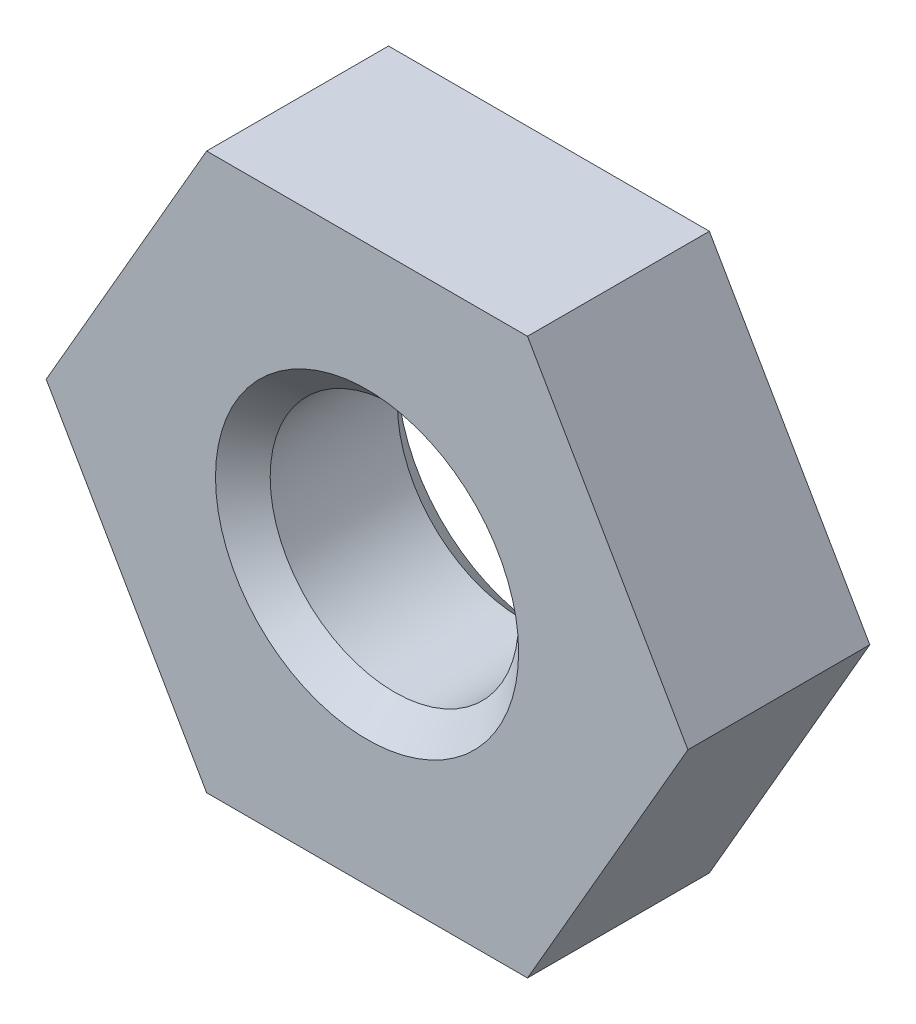
ISO-10303-21;
HEADER;
FILE_DESCRIPTION(('STEP AP214'),'2;1');
FILE_NAME('part.step','',(''),(''),'','','');
FILE_SCHEMA(('AUTOMOTIVE_DESIGN { 1 0 10303 214 1 1 1 1 }'));
ENDSEC;
DATA;
#1=APPLICATION_CONTEXT('core data for automotive mechanical design processes');
#2=APPLICATION_PROTOCOL_DEFINITION('international standard','automotive_design',2000,#1);
#3=PRODUCT_CONTEXT('',#1,'mechanical');
#4=PRODUCT('Part','Part','',(#3));
#5=PRODUCT_RELATED_PRODUCT_CATEGORY('part','',(#4));
#6=PRODUCT_DEFINITION_FORMATION('','',#4);
#7=PRODUCT_DEFINITION_CONTEXT('part definition',#1,'design');
#8=PRODUCT_DEFINITION('design','',#6,#7);
#9=PRODUCT_DEFINITION_SHAPE('','',#8);
#10=(LENGTH_UNIT() NAMED_UNIT(*) SI_UNIT(.MILLI.,.METRE.));
#11=(NAMED_UNIT(*) PLANE_ANGLE_UNIT() SI_UNIT($,.RADIAN.));
#12=(NAMED_UNIT(*) SI_UNIT($,.STERADIAN.) SOLID_ANGLE_UNIT());
#13=UNCERTAINTY_MEASURE_WITH_UNIT(LENGTH_MEASURE(1.E-05),#10,'distance_accuracy_value','');
#14=(GEOMETRIC_REPRESENTATION_CONTEXT(3) GLOBAL_UNCERTAINTY_ASSIGNED_CONTEXT((#13)) GLOBAL_UNIT_ASSIGNED_CONTEXT((#10,
#11,#12)) REPRESENTATION_CONTEXT('',''));
#15=CARTESIAN_POINT('',(0.,0.,0.));
#16=DIRECTION('',(0.,0.,1.));
#17=DIRECTION('',(1.,0.,0.));
#18=AXIS2_PLACEMENT_3D('',#15,#16,#17);
#19=CARTESIAN_POINT('',(2.38156875,1.3749993589061,0.));
#20=DIRECTION('',(0.866025403784439,0.5,0.));
#21=DIRECTION('',(-0.5,0.866025403784439,0.));
#22=AXIS2_PLACEMENT_3D('',#19,#20,#21);
#23=PLANE('',#22);
#24=DIRECTION('',(0.5,-0.866025403784439,0.));
#25=VECTOR('',#24,1.);
#26=CARTESIAN_POINT('',(3.175425,0.,1.8));
#27=LINE('',#26,#25);
#28=CARTESIAN_POINT('',(1.5877125,2.7499987178122,1.8));
#29=VERTEX_POINT('',#28);
#30=CARTESIAN_POINT('',(3.175425,0.,1.8));
#31=VERTEX_POINT('',#30);
#32=EDGE_CURVE('E94',#29,#31,#27,.T.);
#33=ORIENTED_EDGE('',*,*,#32,.T.);
#34=DIRECTION('',(0.,0.,1.));
#35=VECTOR('',#34,1.);
#36=CARTESIAN_POINT('',(3.175425,0.,0.));
#37=LINE('',#36,#35);
#38=CARTESIAN_POINT('',(3.175425,0.,0.));
#39=VERTEX_POINT('',#38);
#40=EDGE_CURVE('E128',#39,#31,#37,.T.);
#41=ORIENTED_EDGE('',*,*,#40,.F.);
#42=DIRECTION('',(-0.5,0.866025403784439,0.));
#43=VECTOR('',#42,1.);
#44=CARTESIAN_POINT('',(3.175425,0.,0.));
#45=LINE('',#44,#43);
#46=CARTESIAN_POINT('',(1.5877125,2.7499987178122,0.));
#47=VERTEX_POINT('',#46);
#48=EDGE_CURVE('E102',#39,#47,#45,.T.);
#49=ORIENTED_EDGE('',*,*,#48,.T.);
#50=DIRECTION('',(0.,0.,1.));
#51=VECTOR('',#50,1.);
#52=CARTESIAN_POINT('',(1.5877125,2.7499987178122,0.));
#53=LINE('',#52,#51);
#54=EDGE_CURVE('E11',#47,#29,#53,.T.);
#55=ORIENTED_EDGE('',*,*,#54,.T.);
#56=EDGE_LOOP('',(#33,#41,#49,#55));
#57=FACE_BOUND('',#56,.T.);
#58=ADVANCED_FACE('F17',(#57),#23,.T.);
#59=CARTESIAN_POINT('',(0.,2.7499987178122,0.));
#60=DIRECTION('',(0.,1.,0.));
#61=DIRECTION('',(-1.,0.,0.));
#62=AXIS2_PLACEMENT_3D('',#59,#60,#61);
#63=PLANE('',#62);
#64=DIRECTION('',(1.,0.,0.));
#65=VECTOR('',#64,1.);
#66=CARTESIAN_POINT('',(1.5877125,2.7499987178122,1.8));
#67=LINE('',#66,#65);
#68=CARTESIAN_POINT('',(-1.5877125,2.7499987178122,1.8));
#69=VERTEX_POINT('',#68);
#70=EDGE_CURVE('E79',#69,#29,#67,.T.);
#71=ORIENTED_EDGE('',*,*,#70,.T.);
#72=ORIENTED_EDGE('',*,*,#54,.F.);
#73=DIRECTION('',(-1.,0.,0.));
#74=VECTOR('',#73,1.);
#75=CARTESIAN_POINT('',(1.5877125,2.7499987178122,0.));
#76=LINE('',#75,#74);
#77=CARTESIAN_POINT('',(-1.5877125,2.7499987178122,0.));
#78=VERTEX_POINT('',#77);
#79=EDGE_CURVE('E82',#47,#78,#76,.T.);
#80=ORIENTED_EDGE('',*,*,#79,.T.);
#81=DIRECTION('',(0.,0.,1.));
#82=VECTOR('',#81,1.);
#83=CARTESIAN_POINT('',(-1.5877125,2.7499987178122,0.));
#84=LINE('',#83,#82);
#85=EDGE_CURVE('E21',#78,#69,#84,.T.);
#86=ORIENTED_EDGE('',*,*,#85,.T.);
#87=EDGE_LOOP('',(#71,#72,#80,#86));
#88=FACE_BOUND('',#87,.T.);
#89=ADVANCED_FACE('F77',(#88),#63,.T.);
#90=CARTESIAN_POINT('',(-2.38156875,1.3749993589061,0.));
#91=DIRECTION('',(-0.866025403784439,0.5,0.));
#92=DIRECTION('',(-0.5,-0.866025403784439,0.));
#93=AXIS2_PLACEMENT_3D('',#90,#91,#92);
#94=PLANE('',#93);
#95=DIRECTION('',(0.5,0.866025403784439,0.));
#96=VECTOR('',#95,1.);
#97=CARTESIAN_POINT('',(-1.5877125,2.7499987178122,1.8));
#98=LINE('',#97,#96);
#99=CARTESIAN_POINT('',(-3.175425,0.,1.8));
#100=VERTEX_POINT('',#99);
#101=EDGE_CURVE('E85',#100,#69,#98,.T.);
#102=ORIENTED_EDGE('',*,*,#101,.T.);
#103=ORIENTED_EDGE('',*,*,#85,.F.);
#104=DIRECTION('',(-0.5,-0.866025403784439,0.));
#105=VECTOR('',#104,1.);
#106=CARTESIAN_POINT('',(-1.5877125,2.7499987178122,0.));
#107=LINE('',#106,#105);
#108=CARTESIAN_POINT('',(-3.175425,0.,0.));
#109=VERTEX_POINT('',#108);
#110=EDGE_CURVE('E110',#78,#109,#107,.T.);
#111=ORIENTED_EDGE('',*,*,#110,.T.);
#112=DIRECTION('',(0.,0.,1.));
#113=VECTOR('',#112,1.);
#114=CARTESIAN_POINT('',(-3.175425,0.,0.));
#115=LINE('',#114,#113);
#116=EDGE_CURVE('E74',#109,#100,#115,.T.);
#117=ORIENTED_EDGE('',*,*,#116,.T.);
#118=EDGE_LOOP('',(#102,#103,#111,#117));
#119=FACE_BOUND('',#118,.T.);
#120=ADVANCED_FACE('F86',(#119),#94,.T.);
#121=CARTESIAN_POINT('',(-2.38156875,-1.3749993589061,0.));
#122=DIRECTION('',(-0.866025403784439,-0.5,0.));
#123=DIRECTION('',(0.5,-0.866025403784439,0.));
#124=AXIS2_PLACEMENT_3D('',#121,#122,#123);
#125=PLANE('',#124);
#126=DIRECTION('',(-0.5,0.866025403784439,0.));
#127=VECTOR('',#126,1.);
#128=CARTESIAN_POINT('',(-3.175425,0.,1.8));
#129=LINE('',#128,#127);
#130=CARTESIAN_POINT('',(-1.5877125,-2.7499987178122,1.8));
#131=VERTEX_POINT('',#130);
#132=EDGE_CURVE('E89',#131,#100,#129,.T.);
#133=ORIENTED_EDGE('',*,*,#132,.T.);
#134=ORIENTED_EDGE('',*,*,#116,.F.);
#135=DIRECTION('',(0.5,-0.866025403784439,0.));
#136=VECTOR('',#135,1.);
#137=CARTESIAN_POINT('',(-3.175425,0.,0.));
#138=LINE('',#137,#136);
#139=CARTESIAN_POINT('',(-1.5877125,-2.7499987178122,0.));
#140=VERTEX_POINT('',#139);
#141=EDGE_CURVE('E109',#109,#140,#138,.T.);
#142=ORIENTED_EDGE('',*,*,#141,.T.);
#143=DIRECTION('',(0.,0.,1.));
#144=VECTOR('',#143,1.);
#145=CARTESIAN_POINT('',(-1.5877125,-2.7499987178122,0.));
#146=LINE('',#145,#144);
#147=EDGE_CURVE('E71',#140,#131,#146,.T.);
#148=ORIENTED_EDGE('',*,*,#147,.T.);
#149=EDGE_LOOP('',(#133,#134,#142,#148));
#150=FACE_BOUND('',#149,.T.);
#151=ADVANCED_FACE('F172',(#150),#125,.T.);
#152=CARTESIAN_POINT('',(0.,-2.7499987178122,0.));
#153=DIRECTION('',(0.,-1.,0.));
#154=DIRECTION('',(1.,0.,0.));
#155=AXIS2_PLACEMENT_3D('',#152,#153,#154);
#156=PLANE('',#155);
#157=DIRECTION('',(-1.,0.,0.));
#158=VECTOR('',#157,1.);
#159=CARTESIAN_POINT('',(-1.5877125,-2.7499987178122,1.8));
#160=LINE('',#159,#158);
#161=CARTESIAN_POINT('',(1.5877125,-2.7499987178122,1.8));
#162=VERTEX_POINT('',#161);
#163=EDGE_CURVE('E100',#162,#131,#160,.T.);
#164=ORIENTED_EDGE('',*,*,#163,.T.);
#165=ORIENTED_EDGE('',*,*,#147,.F.);
#166=DIRECTION('',(1.,0.,0.));
#167=VECTOR('',#166,1.);
#168=CARTESIAN_POINT('',(-1.5877125,-2.7499987178122,0.));
#169=LINE('',#168,#167);
#170=CARTESIAN_POINT('',(1.5877125,-2.7499987178122,0.));
#171=VERTEX_POINT('',#170);
#172=EDGE_CURVE('E106',#140,#171,#169,.T.);
#173=ORIENTED_EDGE('',*,*,#172,.T.);
#174=DIRECTION('',(0.,0.,1.));
#175=VECTOR('',#174,1.);
#176=CARTESIAN_POINT('',(1.5877125,-2.7499987178122,0.));
#177=LINE('',#176,#175);
#178=EDGE_CURVE('E125',#171,#162,#177,.T.);
#179=ORIENTED_EDGE('',*,*,#178,.T.);
#180=EDGE_LOOP('',(#164,#165,#173,#179));
#181=FACE_BOUND('',#180,.T.);
#182=ADVANCED_FACE('F124',(#181),#156,.T.);
#183=CARTESIAN_POINT('',(2.38156875,-1.3749993589061,0.));
#184=DIRECTION('',(0.866025403784439,-0.5,0.));
#185=DIRECTION('',(0.5,0.866025403784439,0.));
#186=AXIS2_PLACEMENT_3D('',#183,#184,#185);
#187=PLANE('',#186);
#188=DIRECTION('',(-0.5,-0.866025403784439,0.));
#189=VECTOR('',#188,1.);
#190=CARTESIAN_POINT('',(1.5877125,-2.7499987178122,1.8));
#191=LINE('',#190,#189);
#192=EDGE_CURVE('E96',#31,#162,#191,.T.);
#193=ORIENTED_EDGE('',*,*,#192,.T.);
#194=ORIENTED_EDGE('',*,*,#178,.F.);
#195=DIRECTION('',(0.5,0.866025403784439,0.));
#196=VECTOR('',#195,1.);
#197=CARTESIAN_POINT('',(1.5877125,-2.7499987178122,0.));
#198=LINE('',#197,#196);
#199=EDGE_CURVE('E105',#171,#39,#198,.T.);
#200=ORIENTED_EDGE('',*,*,#199,.T.);
#201=ORIENTED_EDGE('',*,*,#40,.T.);
#202=EDGE_LOOP('',(#193,#194,#200,#201));
#203=FACE_BOUND('',#202,.T.);
#204=ADVANCED_FACE('F19',(#203),#187,.T.);
#205=CARTESIAN_POINT('',(0.,0.,0.));
#206=DIRECTION('',(0.,0.,1.));
#207=DIRECTION('',(1.,0.,0.));
#208=AXIS2_PLACEMENT_3D('',#205,#206,#207);
#209=PLANE('',#208);
#210=CARTESIAN_POINT('',(0.,0.,0.));
#211=DIRECTION('',(0.,0.,-1.));
#212=DIRECTION('',(1.,0.,0.));
#213=AXIS2_PLACEMENT_3D('',#210,#211,#212);
#214=CIRCLE('',#213,1.5);
#215=CARTESIAN_POINT('',(1.5,0.,0.));
#216=VERTEX_POINT('',#215);
#217=EDGE_CURVE('E115',#216,#216,#214,.T.);
#218=ORIENTED_EDGE('',*,*,#217,.F.);
#219=EDGE_LOOP('',(#218));
#220=FACE_BOUND('',#219,.T.);
#221=ORIENTED_EDGE('',*,*,#48,.F.);
#222=ORIENTED_EDGE('',*,*,#199,.F.);
#223=ORIENTED_EDGE('',*,*,#172,.F.);
#224=ORIENTED_EDGE('',*,*,#141,.F.);
#225=ORIENTED_EDGE('',*,*,#110,.F.);
#226=ORIENTED_EDGE('',*,*,#79,.F.);
#227=EDGE_LOOP('',(#221,#222,#223,#224,#225,#226));
#228=FACE_BOUND('',#227,.T.);
#229=ADVANCED_FACE('F136',(#220,#228),#209,.F.);
#230=CARTESIAN_POINT('',(0.,0.,1.8));
#231=DIRECTION('',(0.,0.,1.));
#232=DIRECTION('',(1.,0.,0.));
#233=AXIS2_PLACEMENT_3D('',#230,#231,#232);
#234=PLANE('',#233);
#235=CARTESIAN_POINT('',(0.,0.,1.8));
#236=DIRECTION('',(0.,0.,1.));
#237=DIRECTION('',(1.,0.,0.));
#238=AXIS2_PLACEMENT_3D('',#235,#236,#237);
#239=CIRCLE('',#238,1.5);
#240=CARTESIAN_POINT('',(1.5,0.,1.8));
#241=VERTEX_POINT('',#240);
#242=EDGE_CURVE('E116',#241,#241,#239,.T.);
#243=ORIENTED_EDGE('',*,*,#242,.F.);
#244=EDGE_LOOP('',(#243));
#245=FACE_BOUND('',#244,.T.);
#246=ORIENTED_EDGE('',*,*,#192,.F.);
#247=ORIENTED_EDGE('',*,*,#32,.F.);
#248=ORIENTED_EDGE('',*,*,#70,.F.);
#249=ORIENTED_EDGE('',*,*,#101,.F.);
#250=ORIENTED_EDGE('',*,*,#132,.F.);
#251=ORIENTED_EDGE('',*,*,#163,.F.);
#252=EDGE_LOOP('',(#246,#247,#248,#249,#250,#251));
#253=FACE_BOUND('',#252,.T.);
#254=ADVANCED_FACE('F92',(#245,#253),#234,.T.);
#255=CARTESIAN_POINT('',(0.,0.,0.1353125));
#256=DIRECTION('',(0.,0.,-1.));
#257=DIRECTION('',(1.,0.,0.));
#258=AXIS2_PLACEMENT_3D('',#255,#256,#257);
#259=CONICAL_SURFACE('',#258,1.3646875,0.785398163397448);
#260=CARTESIAN_POINT('',(0.,0.,0.270625));
#261=DIRECTION('',(0.,0.,1.));
#262=DIRECTION('',(1.,0.,0.));
#263=AXIS2_PLACEMENT_3D('',#260,#261,#262);
#264=CIRCLE('',#263,1.229375);
#265=CARTESIAN_POINT('',(1.229375,0.,0.270625));
#266=VERTEX_POINT('',#265);
#267=EDGE_CURVE('E112',#266,#266,#264,.T.);
#268=ORIENTED_EDGE('',*,*,#267,.T.);
#269=EDGE_LOOP('',(#268));
#270=FACE_BOUND('',#269,.T.);
#271=ORIENTED_EDGE('',*,*,#217,.T.);
#272=EDGE_LOOP('',(#271));
#273=FACE_BOUND('',#272,.T.);
#274=ADVANCED_FACE('F153',(#270,#273),#259,.F.);
#275=CARTESIAN_POINT('',(0.,0.,0.9));
#276=DIRECTION('',(0.,0.,-1.));
#277=DIRECTION('',(1.,0.,0.));
#278=AXIS2_PLACEMENT_3D('',#275,#276,#277);
#279=CYLINDRICAL_SURFACE('',#278,1.229375);
#280=CARTESIAN_POINT('',(0.,0.,1.529375));
#281=DIRECTION('',(0.,0.,1.));
#282=DIRECTION('',(1.,0.,0.));
#283=AXIS2_PLACEMENT_3D('',#280,#281,#282);
#284=CIRCLE('',#283,1.229375);
#285=CARTESIAN_POINT('',(1.229375,0.,1.529375));
#286=VERTEX_POINT('',#285);
#287=EDGE_CURVE('E144',#286,#286,#284,.T.);
#288=ORIENTED_EDGE('',*,*,#287,.T.);
#289=EDGE_LOOP('',(#288));
#290=FACE_BOUND('',#289,.T.);
#291=ORIENTED_EDGE('',*,*,#267,.F.);
#292=EDGE_LOOP('',(#291));
#293=FACE_BOUND('',#292,.T.);
#294=ADVANCED_FACE('F160',(#290,#293),#279,.F.);
#295=CARTESIAN_POINT('',(0.,0.,1.6646875));
#296=DIRECTION('',(0.,0.,1.));
#297=DIRECTION('',(1.,0.,0.));
#298=AXIS2_PLACEMENT_3D('',#295,#296,#297);
#299=CONICAL_SURFACE('',#298,1.3646875,0.785398163397448);
#300=ORIENTED_EDGE('',*,*,#242,.T.);
#301=EDGE_LOOP('',(#300));
#302=FACE_BOUND('',#301,.T.);
#303=ORIENTED_EDGE('',*,*,#287,.F.);
#304=EDGE_LOOP('',(#303));
#305=FACE_BOUND('',#304,.T.);
#306=ADVANCED_FACE('F149',(#302,#305),#299,.F.);
#307=CLOSED_SHELL('',(#58,#89,#120,#151,#182,#204,#229,#254,#274,#294,#306));
#308=MANIFOLD_SOLID_BREP('B1',#307);
#309=ADVANCED_BREP_SHAPE_REPRESENTATION('',(#18,#308),#14);
#310=SHAPE_DEFINITION_REPRESENTATION(#9,#309);
ENDSEC;
END-ISO-10303-21;
